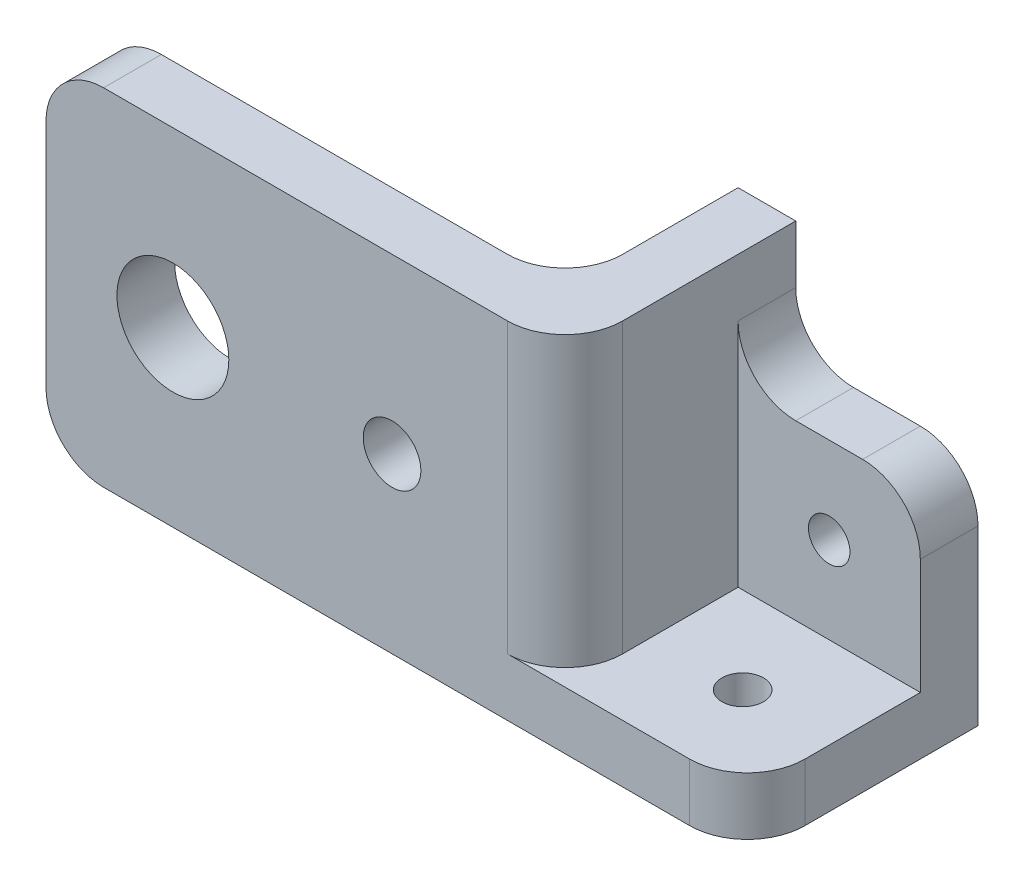
ISO-10303-21;
HEADER;
FILE_DESCRIPTION(('STEP AP214'),'2;1');
FILE_NAME('part.step','',(''),(''),'','','');
FILE_SCHEMA(('AUTOMOTIVE_DESIGN { 1 0 10303 214 1 1 1 1 }'));
ENDSEC;
DATA;
#1=APPLICATION_CONTEXT('core data for automotive mechanical design processes');
#2=APPLICATION_PROTOCOL_DEFINITION('international standard','automotive_design',2000,#1);
#3=PRODUCT_CONTEXT('',#1,'mechanical');
#4=PRODUCT('Part','Part','',(#3));
#5=PRODUCT_RELATED_PRODUCT_CATEGORY('part','',(#4));
#6=PRODUCT_DEFINITION_FORMATION('','',#4);
#7=PRODUCT_DEFINITION_CONTEXT('part definition',#1,'design');
#8=PRODUCT_DEFINITION('design','',#6,#7);
#9=PRODUCT_DEFINITION_SHAPE('','',#8);
#10=(LENGTH_UNIT() NAMED_UNIT(*) SI_UNIT(.MILLI.,.METRE.));
#11=(NAMED_UNIT(*) PLANE_ANGLE_UNIT() SI_UNIT($,.RADIAN.));
#12=(NAMED_UNIT(*) SI_UNIT($,.STERADIAN.) SOLID_ANGLE_UNIT());
#13=UNCERTAINTY_MEASURE_WITH_UNIT(LENGTH_MEASURE(1.E-05),#10,'distance_accuracy_value','');
#14=(GEOMETRIC_REPRESENTATION_CONTEXT(3) GLOBAL_UNCERTAINTY_ASSIGNED_CONTEXT((#13)) GLOBAL_UNIT_ASSIGNED_CONTEXT((#10,
#11,#12)) REPRESENTATION_CONTEXT('',''));
#15=CARTESIAN_POINT('',(0.,0.,0.));
#16=DIRECTION('',(0.,0.,1.));
#17=DIRECTION('',(1.,0.,0.));
#18=AXIS2_PLACEMENT_3D('',#15,#16,#17);
#19=CARTESIAN_POINT('',(10.033,6.35,12.7));
#20=DIRECTION('',(-1.,0.,0.));
#21=DIRECTION('',(0.,0.,1.));
#22=AXIS2_PLACEMENT_3D('',#19,#20,#21);
#23=PLANE('',#22);
#24=DIRECTION('',(0.,-1.,0.));
#25=VECTOR('',#24,1.);
#26=CARTESIAN_POINT('',(10.033,6.35,-12.7));
#27=LINE('',#26,#25);
#28=CARTESIAN_POINT('',(10.033,19.05,-12.7));
#29=VERTEX_POINT('',#28);
#30=CARTESIAN_POINT('',(10.033,0.,-12.7));
#31=VERTEX_POINT('',#30);
#32=EDGE_CURVE('E162',#29,#31,#27,.T.);
#33=ORIENTED_EDGE('',*,*,#32,.F.);
#34=DIRECTION('',(0.,0.,-1.));
#35=VECTOR('',#34,1.);
#36=CARTESIAN_POINT('',(10.033,19.05,-6.35));
#37=LINE('',#36,#35);
#38=CARTESIAN_POINT('',(10.033,19.05,-6.35));
#39=VERTEX_POINT('',#38);
#40=EDGE_CURVE('E56',#29,#39,#37,.F.);
#41=ORIENTED_EDGE('',*,*,#40,.T.);
#42=DIRECTION('',(0.,-1.,0.));
#43=VECTOR('',#42,1.);
#44=CARTESIAN_POINT('',(10.033,0.,-6.35));
#45=LINE('',#44,#43);
#46=CARTESIAN_POINT('',(10.033,6.35,-6.35));
#47=VERTEX_POINT('',#46);
#48=EDGE_CURVE('E202',#39,#47,#45,.T.);
#49=ORIENTED_EDGE('',*,*,#48,.T.);
#50=DIRECTION('',(0.,0.,-1.));
#51=VECTOR('',#50,1.);
#52=CARTESIAN_POINT('',(10.033,6.35,12.7));
#53=LINE('',#52,#51);
#54=CARTESIAN_POINT('',(10.033,6.35,6.35));
#55=VERTEX_POINT('',#54);
#56=EDGE_CURVE('E212',#55,#47,#53,.T.);
#57=ORIENTED_EDGE('',*,*,#56,.F.);
#58=DIRECTION('',(0.,-1.,0.));
#59=VECTOR('',#58,1.);
#60=CARTESIAN_POINT('',(10.033,6.35,6.35));
#61=LINE('',#60,#59);
#62=CARTESIAN_POINT('',(10.033,0.,6.35));
#63=VERTEX_POINT('',#62);
#64=EDGE_CURVE('E274',#55,#63,#61,.T.);
#65=ORIENTED_EDGE('',*,*,#64,.T.);
#66=DIRECTION('',(0.,0.,-1.));
#67=VECTOR('',#66,1.);
#68=CARTESIAN_POINT('',(10.033,0.,12.7));
#69=LINE('',#68,#67);
#70=EDGE_CURVE('E167',#63,#31,#69,.T.);
#71=ORIENTED_EDGE('',*,*,#70,.T.);
#72=EDGE_LOOP('',(#33,#41,#49,#57,#65,#71));
#73=FACE_BOUND('',#72,.T.);
#74=ADVANCED_FACE('F33',(#73),#23,.F.);
#75=CARTESIAN_POINT('',(-10.033,6.35,-12.7));
#76=DIRECTION('',(0.,0.,1.));
#77=DIRECTION('',(1.,0.,0.));
#78=AXIS2_PLACEMENT_3D('',#75,#76,#77);
#79=PLANE('',#78);
#80=CARTESIAN_POINT('',(0.,15.875,-12.7));
#81=DIRECTION('',(0.,0.,1.));
#82=DIRECTION('',(1.,0.,0.));
#83=AXIS2_PLACEMENT_3D('',#80,#81,#82);
#84=CIRCLE('',#83,2.286);
#85=CARTESIAN_POINT('',(2.286,15.875,-12.7));
#86=VERTEX_POINT('',#85);
#87=EDGE_CURVE('E562',#86,#86,#84,.T.);
#88=ORIENTED_EDGE('',*,*,#87,.T.);
#89=EDGE_LOOP('',(#88));
#90=FACE_BOUND('',#89,.T.);
#91=DIRECTION('',(1.,0.,0.));
#92=VECTOR('',#91,1.);
#93=CARTESIAN_POINT('',(10.033,25.4,-12.7));
#94=LINE('',#93,#92);
#95=CARTESIAN_POINT('',(-3.683,25.4,-12.7));
#96=VERTEX_POINT('',#95);
#97=CARTESIAN_POINT('',(3.683,25.4,-12.7));
#98=VERTEX_POINT('',#97);
#99=EDGE_CURVE('E201',#96,#98,#94,.T.);
#100=ORIENTED_EDGE('',*,*,#99,.T.);
#101=CARTESIAN_POINT('',(3.683,19.05,-12.7));
#102=DIRECTION('',(0.,0.,1.));
#103=DIRECTION('',(1.,0.,0.));
#104=AXIS2_PLACEMENT_3D('',#101,#102,#103);
#105=CIRCLE('',#104,6.35);
#106=EDGE_CURVE('E272',#98,#29,#105,.F.);
#107=ORIENTED_EDGE('',*,*,#106,.T.);
#108=ORIENTED_EDGE('',*,*,#32,.T.);
#109=DIRECTION('',(-1.,0.,0.));
#110=VECTOR('',#109,1.);
#111=CARTESIAN_POINT('',(-10.033,0.,-12.7));
#112=LINE('',#111,#110);
#113=CARTESIAN_POINT('',(-16.383,0.,-12.7));
#114=VERTEX_POINT('',#113);
#115=EDGE_CURVE('E155',#31,#114,#112,.T.);
#116=ORIENTED_EDGE('',*,*,#115,.T.);
#117=DIRECTION('',(0.,-1.,0.));
#118=VECTOR('',#117,1.);
#119=CARTESIAN_POINT('',(-16.383,0.,-12.7));
#120=LINE('',#119,#118);
#121=CARTESIAN_POINT('',(-16.383,38.1,-12.7));
#122=VERTEX_POINT('',#121);
#123=EDGE_CURVE('E161',#122,#114,#120,.T.);
#124=ORIENTED_EDGE('',*,*,#123,.F.);
#125=DIRECTION('',(1.,0.,0.));
#126=VECTOR('',#125,1.);
#127=CARTESIAN_POINT('',(-16.383,38.1,-12.7));
#128=LINE('',#127,#126);
#129=CARTESIAN_POINT('',(-10.033,38.1,-12.7));
#130=VERTEX_POINT('',#129);
#131=EDGE_CURVE('E193',#122,#130,#128,.T.);
#132=ORIENTED_EDGE('',*,*,#131,.T.);
#133=DIRECTION('',(0.,-1.,0.));
#134=VECTOR('',#133,1.);
#135=CARTESIAN_POINT('',(-10.033,0.,-12.7));
#136=LINE('',#135,#134);
#137=CARTESIAN_POINT('',(-10.033,31.75,-12.7));
#138=VERTEX_POINT('',#137);
#139=EDGE_CURVE('E186',#130,#138,#136,.T.);
#140=ORIENTED_EDGE('',*,*,#139,.T.);
#141=CARTESIAN_POINT('',(-3.683,31.75,-12.7));
#142=DIRECTION('',(0.,0.,1.));
#143=DIRECTION('',(1.,0.,0.));
#144=AXIS2_PLACEMENT_3D('',#141,#142,#143);
#145=CIRCLE('',#144,6.35);
#146=EDGE_CURVE('E41',#138,#96,#145,.T.);
#147=ORIENTED_EDGE('',*,*,#146,.T.);
#148=EDGE_LOOP('',(#100,#107,#108,#116,#124,#132,#140,#147));
#149=FACE_BOUND('',#148,.T.);
#150=ADVANCED_FACE('F158',(#90,#149),#79,.F.);
#151=CARTESIAN_POINT('',(-10.033,6.35,12.7));
#152=DIRECTION('',(0.,0.,-1.));
#153=DIRECTION('',(-1.,0.,0.));
#154=AXIS2_PLACEMENT_3D('',#151,#152,#153);
#155=PLANE('',#154);
#156=CARTESIAN_POINT('',(-53.213,19.05,12.7));
#157=DIRECTION('',(0.,0.,1.));
#158=DIRECTION('',(1.,0.,0.));
#159=AXIS2_PLACEMENT_3D('',#156,#157,#158);
#160=CIRCLE('',#159,6.15950000000001);
#161=CARTESIAN_POINT('',(-47.0535,19.05,12.7));
#162=VERTEX_POINT('',#161);
#163=EDGE_CURVE('E228',#162,#162,#160,.T.);
#164=ORIENTED_EDGE('',*,*,#163,.F.);
#165=EDGE_LOOP('',(#164));
#166=FACE_BOUND('',#165,.T.);
#167=CARTESIAN_POINT('',(-29.083,19.05,12.7));
#168=DIRECTION('',(0.,0.,1.));
#169=DIRECTION('',(1.,0.,0.));
#170=AXIS2_PLACEMENT_3D('',#167,#168,#169);
#171=CIRCLE('',#170,3.175);
#172=CARTESIAN_POINT('',(-25.908,19.05,12.7));
#173=VERTEX_POINT('',#172);
#174=EDGE_CURVE('E582',#173,#173,#171,.T.);
#175=ORIENTED_EDGE('',*,*,#174,.F.);
#176=EDGE_LOOP('',(#175));
#177=FACE_BOUND('',#176,.T.);
#178=DIRECTION('',(0.,-1.,0.));
#179=VECTOR('',#178,1.);
#180=CARTESIAN_POINT('',(-67.183,38.1,12.7));
#181=LINE('',#180,#179);
#182=CARTESIAN_POINT('',(-67.183,31.75,12.7));
#183=VERTEX_POINT('',#182);
#184=CARTESIAN_POINT('',(-67.183,6.35000000000002,12.7));
#185=VERTEX_POINT('',#184);
#186=EDGE_CURVE('E189',#183,#185,#181,.T.);
#187=ORIENTED_EDGE('',*,*,#186,.T.);
#188=CARTESIAN_POINT('',(-60.833,6.35,12.7));
#189=DIRECTION('',(0.,0.,-1.));
#190=DIRECTION('',(-1.,0.,0.));
#191=AXIS2_PLACEMENT_3D('',#188,#189,#190);
#192=CIRCLE('',#191,6.35);
#193=CARTESIAN_POINT('',(-60.833,0.,12.7));
#194=VERTEX_POINT('',#193);
#195=EDGE_CURVE('E243',#185,#194,#192,.F.);
#196=ORIENTED_EDGE('',*,*,#195,.T.);
#197=DIRECTION('',(1.,0.,0.));
#198=VECTOR('',#197,1.);
#199=CARTESIAN_POINT('',(-10.033,0.,12.7));
#200=LINE('',#199,#198);
#201=CARTESIAN_POINT('',(3.683,0.,12.7));
#202=VERTEX_POINT('',#201);
#203=EDGE_CURVE('E166',#194,#202,#200,.T.);
#204=ORIENTED_EDGE('',*,*,#203,.T.);
#205=DIRECTION('',(0.,-1.,0.));
#206=VECTOR('',#205,1.);
#207=CARTESIAN_POINT('',(3.683,6.35,12.7));
#208=LINE('',#207,#206);
#209=CARTESIAN_POINT('',(3.683,6.35,12.7));
#210=VERTEX_POINT('',#209);
#211=EDGE_CURVE('E236',#202,#210,#208,.F.);
#212=ORIENTED_EDGE('',*,*,#211,.T.);
#213=DIRECTION('',(1.,0.,0.));
#214=VECTOR('',#213,1.);
#215=CARTESIAN_POINT('',(-10.033,6.35,12.7));
#216=LINE('',#215,#214);
#217=CARTESIAN_POINT('',(-16.383,6.35,12.7));
#218=VERTEX_POINT('',#217);
#219=EDGE_CURVE('E217',#218,#210,#216,.T.);
#220=ORIENTED_EDGE('',*,*,#219,.F.);
#221=DIRECTION('',(0.,1.,0.));
#222=VECTOR('',#221,1.);
#223=CARTESIAN_POINT('',(-16.383,38.1,12.7));
#224=LINE('',#223,#222);
#225=CARTESIAN_POINT('',(-16.383,38.1,12.7));
#226=VERTEX_POINT('',#225);
#227=EDGE_CURVE('E238',#218,#226,#224,.T.);
#228=ORIENTED_EDGE('',*,*,#227,.T.);
#229=DIRECTION('',(1.,0.,0.));
#230=VECTOR('',#229,1.);
#231=CARTESIAN_POINT('',(-16.383,38.1,12.7));
#232=LINE('',#231,#230);
#233=CARTESIAN_POINT('',(-60.833,38.1,12.7));
#234=VERTEX_POINT('',#233);
#235=EDGE_CURVE('E198',#234,#226,#232,.T.);
#236=ORIENTED_EDGE('',*,*,#235,.F.);
#237=CARTESIAN_POINT('',(-60.833,31.75,12.7));
#238=DIRECTION('',(0.,0.,-1.));
#239=DIRECTION('',(-1.,0.,0.));
#240=AXIS2_PLACEMENT_3D('',#237,#238,#239);
#241=CIRCLE('',#240,6.35);
#242=EDGE_CURVE('E241',#234,#183,#241,.F.);
#243=ORIENTED_EDGE('',*,*,#242,.T.);
#244=EDGE_LOOP('',(#187,#196,#204,#212,#220,#228,#236,#243));
#245=FACE_BOUND('',#244,.T.);
#246=ADVANCED_FACE('F311',(#166,#177,#245),#155,.F.);
#247=CARTESIAN_POINT('',(0.,6.35,0.));
#248=DIRECTION('',(0.,-1.,0.));
#249=DIRECTION('',(0.,0.,-1.));
#250=AXIS2_PLACEMENT_3D('',#247,#248,#249);
#251=PLANE('',#250);
#252=CARTESIAN_POINT('',(0.,6.35,3.175));
#253=DIRECTION('',(0.,1.,0.));
#254=DIRECTION('',(0.,0.,1.));
#255=AXIS2_PLACEMENT_3D('',#252,#253,#254);
#256=CIRCLE('',#255,2.286);
#257=CARTESIAN_POINT('',(0.,6.35,5.461));
#258=VERTEX_POINT('',#257);
#259=EDGE_CURVE('E231',#258,#258,#256,.T.);
#260=ORIENTED_EDGE('',*,*,#259,.F.);
#261=EDGE_LOOP('',(#260));
#262=FACE_BOUND('',#261,.T.);
#263=ORIENTED_EDGE('',*,*,#219,.T.);
#264=CARTESIAN_POINT('',(3.683,6.35,6.35));
#265=DIRECTION('',(0.,-1.,0.));
#266=DIRECTION('',(0.,0.,-1.));
#267=AXIS2_PLACEMENT_3D('',#264,#265,#266);
#268=CIRCLE('',#267,6.35);
#269=EDGE_CURVE('E48',#210,#55,#268,.F.);
#270=ORIENTED_EDGE('',*,*,#269,.T.);
#271=ORIENTED_EDGE('',*,*,#56,.T.);
#272=DIRECTION('',(-1.,0.,0.));
#273=VECTOR('',#272,1.);
#274=CARTESIAN_POINT('',(0.,6.35,-6.35));
#275=LINE('',#274,#273);
#276=CARTESIAN_POINT('',(-10.033,6.35,-6.35));
#277=VERTEX_POINT('',#276);
#278=EDGE_CURVE('E209',#47,#277,#275,.T.);
#279=ORIENTED_EDGE('',*,*,#278,.T.);
#280=DIRECTION('',(0.,0.,1.));
#281=VECTOR('',#280,1.);
#282=CARTESIAN_POINT('',(-10.033,6.35,12.7));
#283=LINE('',#282,#281);
#284=CARTESIAN_POINT('',(-10.033,6.35,6.35));
#285=VERTEX_POINT('',#284);
#286=EDGE_CURVE('E214',#277,#285,#283,.T.);
#287=ORIENTED_EDGE('',*,*,#286,.T.);
#288=CARTESIAN_POINT('',(-16.383,6.35,6.35));
#289=DIRECTION('',(0.,-1.,0.));
#290=DIRECTION('',(0.,0.,-1.));
#291=AXIS2_PLACEMENT_3D('',#288,#289,#290);
#292=CIRCLE('',#291,6.35);
#293=EDGE_CURVE('E284',#285,#218,#292,.T.);
#294=ORIENTED_EDGE('',*,*,#293,.T.);
#295=EDGE_LOOP('',(#263,#270,#271,#279,#287,#294));
#296=FACE_BOUND('',#295,.T.);
#297=ADVANCED_FACE('F457',(#262,#296),#251,.F.);
#298=CARTESIAN_POINT('',(0.,0.,0.));
#299=DIRECTION('',(0.,-1.,0.));
#300=DIRECTION('',(0.,0.,-1.));
#301=AXIS2_PLACEMENT_3D('',#298,#299,#300);
#302=PLANE('',#301);
#303=CARTESIAN_POINT('',(0.,0.,3.175));
#304=DIRECTION('',(0.,1.,0.));
#305=DIRECTION('',(0.,0.,1.));
#306=AXIS2_PLACEMENT_3D('',#303,#304,#305);
#307=CIRCLE('',#306,2.286);
#308=CARTESIAN_POINT('',(0.,0.,5.461));
#309=VERTEX_POINT('',#308);
#310=EDGE_CURVE('E570',#309,#309,#307,.T.);
#311=ORIENTED_EDGE('',*,*,#310,.T.);
#312=EDGE_LOOP('',(#311));
#313=FACE_BOUND('',#312,.T.);
#314=ORIENTED_EDGE('',*,*,#203,.F.);
#315=DIRECTION('',(0.,0.,1.));
#316=VECTOR('',#315,1.);
#317=CARTESIAN_POINT('',(-60.833,0.,0.));
#318=LINE('',#317,#316);
#319=CARTESIAN_POINT('',(-60.833,0.,6.35));
#320=VERTEX_POINT('',#319);
#321=EDGE_CURVE('E247',#194,#320,#318,.F.);
#322=ORIENTED_EDGE('',*,*,#321,.T.);
#323=DIRECTION('',(1.,0.,0.));
#324=VECTOR('',#323,1.);
#325=CARTESIAN_POINT('',(-16.383,0.,6.35));
#326=LINE('',#325,#324);
#327=CARTESIAN_POINT('',(-22.733,0.,6.35));
#328=VERTEX_POINT('',#327);
#329=EDGE_CURVE('E195',#320,#328,#326,.T.);
#330=ORIENTED_EDGE('',*,*,#329,.T.);
#331=CARTESIAN_POINT('',(-22.733,0.,0.));
#332=DIRECTION('',(0.,-1.,0.));
#333=DIRECTION('',(0.,0.,-1.));
#334=AXIS2_PLACEMENT_3D('',#331,#332,#333);
#335=CIRCLE('',#334,6.35);
#336=CARTESIAN_POINT('',(-16.383,0.,0.));
#337=VERTEX_POINT('',#336);
#338=EDGE_CURVE('E175',#328,#337,#335,.F.);
#339=ORIENTED_EDGE('',*,*,#338,.T.);
#340=DIRECTION('',(0.,0.,1.));
#341=VECTOR('',#340,1.);
#342=CARTESIAN_POINT('',(-16.383,0.,-12.7));
#343=LINE('',#342,#341);
#344=EDGE_CURVE('E170',#114,#337,#343,.T.);
#345=ORIENTED_EDGE('',*,*,#344,.F.);
#346=ORIENTED_EDGE('',*,*,#115,.F.);
#347=ORIENTED_EDGE('',*,*,#70,.F.);
#348=CARTESIAN_POINT('',(3.683,0.,6.35));
#349=DIRECTION('',(0.,-1.,0.));
#350=DIRECTION('',(0.,0.,-1.));
#351=AXIS2_PLACEMENT_3D('',#348,#349,#350);
#352=CIRCLE('',#351,6.35);
#353=EDGE_CURVE('E245',#63,#202,#352,.T.);
#354=ORIENTED_EDGE('',*,*,#353,.T.);
#355=EDGE_LOOP('',(#314,#322,#330,#339,#345,#346,#347,#354));
#356=FACE_BOUND('',#355,.T.);
#357=ADVANCED_FACE('F172',(#313,#356),#302,.T.);
#358=CARTESIAN_POINT('',(0.,0.,-6.35));
#359=DIRECTION('',(0.,0.,1.));
#360=DIRECTION('',(1.,0.,0.));
#361=AXIS2_PLACEMENT_3D('',#358,#359,#360);
#362=PLANE('',#361);
#363=CARTESIAN_POINT('',(0.,15.875,-6.35));
#364=DIRECTION('',(0.,0.,1.));
#365=DIRECTION('',(1.,0.,0.));
#366=AXIS2_PLACEMENT_3D('',#363,#364,#365);
#367=CIRCLE('',#366,2.286);
#368=CARTESIAN_POINT('',(2.286,15.875,-6.35));
#369=VERTEX_POINT('',#368);
#370=EDGE_CURVE('E566',#369,#369,#367,.T.);
#371=ORIENTED_EDGE('',*,*,#370,.F.);
#372=EDGE_LOOP('',(#371));
#373=FACE_BOUND('',#372,.T.);
#374=ORIENTED_EDGE('',*,*,#48,.F.);
#375=CARTESIAN_POINT('',(3.683,19.05,-6.35));
#376=DIRECTION('',(0.,0.,1.));
#377=DIRECTION('',(1.,0.,0.));
#378=AXIS2_PLACEMENT_3D('',#375,#376,#377);
#379=CIRCLE('',#378,6.35);
#380=CARTESIAN_POINT('',(3.683,25.4,-6.35));
#381=VERTEX_POINT('',#380);
#382=EDGE_CURVE('E278',#39,#381,#379,.T.);
#383=ORIENTED_EDGE('',*,*,#382,.T.);
#384=DIRECTION('',(1.,0.,0.));
#385=VECTOR('',#384,1.);
#386=CARTESIAN_POINT('',(10.033,25.4,-6.35));
#387=LINE('',#386,#385);
#388=CARTESIAN_POINT('',(-3.683,25.4,-6.35));
#389=VERTEX_POINT('',#388);
#390=EDGE_CURVE('E206',#389,#381,#387,.T.);
#391=ORIENTED_EDGE('',*,*,#390,.F.);
#392=CARTESIAN_POINT('',(-3.683,31.75,-6.35));
#393=DIRECTION('',(0.,0.,1.));
#394=DIRECTION('',(1.,0.,0.));
#395=AXIS2_PLACEMENT_3D('',#392,#393,#394);
#396=CIRCLE('',#395,6.35);
#397=CARTESIAN_POINT('',(-10.033,31.75,-6.35));
#398=VERTEX_POINT('',#397);
#399=EDGE_CURVE('E11',#389,#398,#396,.F.);
#400=ORIENTED_EDGE('',*,*,#399,.T.);
#401=DIRECTION('',(0.,1.,0.));
#402=VECTOR('',#401,1.);
#403=CARTESIAN_POINT('',(-10.033,0.,-6.35));
#404=LINE('',#403,#402);
#405=EDGE_CURVE('E204',#277,#398,#404,.T.);
#406=ORIENTED_EDGE('',*,*,#405,.F.);
#407=ORIENTED_EDGE('',*,*,#278,.F.);
#408=EDGE_LOOP('',(#374,#383,#391,#400,#406,#407));
#409=FACE_BOUND('',#408,.T.);
#410=ADVANCED_FACE('F299',(#373,#409),#362,.T.);
#411=CARTESIAN_POINT('',(10.033,25.4,-6.35));
#412=DIRECTION('',(0.,1.,0.));
#413=DIRECTION('',(0.,0.,1.));
#414=AXIS2_PLACEMENT_3D('',#411,#412,#413);
#415=PLANE('',#414);
#416=ORIENTED_EDGE('',*,*,#99,.F.);
#417=DIRECTION('',(0.,0.,-1.));
#418=VECTOR('',#417,1.);
#419=CARTESIAN_POINT('',(-3.683,25.4,-6.35));
#420=LINE('',#419,#418);
#421=EDGE_CURVE('E270',#96,#389,#420,.F.);
#422=ORIENTED_EDGE('',*,*,#421,.T.);
#423=ORIENTED_EDGE('',*,*,#390,.T.);
#424=DIRECTION('',(0.,0.,-1.));
#425=VECTOR('',#424,1.);
#426=CARTESIAN_POINT('',(3.683,25.4,-12.7));
#427=LINE('',#426,#425);
#428=EDGE_CURVE('E267',#381,#98,#427,.T.);
#429=ORIENTED_EDGE('',*,*,#428,.T.);
#430=EDGE_LOOP('',(#416,#422,#423,#429));
#431=FACE_BOUND('',#430,.T.);
#432=ADVANCED_FACE('F292',(#431),#415,.T.);
#433=CARTESIAN_POINT('',(-10.033,0.,0.));
#434=DIRECTION('',(1.,0.,0.));
#435=DIRECTION('',(0.,0.,-1.));
#436=AXIS2_PLACEMENT_3D('',#433,#434,#435);
#437=PLANE('',#436);
#438=DIRECTION('',(0.,0.,-1.));
#439=VECTOR('',#438,1.);
#440=CARTESIAN_POINT('',(-10.033,38.1,-12.7));
#441=LINE('',#440,#439);
#442=CARTESIAN_POINT('',(-10.033,38.1,6.35));
#443=VERTEX_POINT('',#442);
#444=EDGE_CURVE('E184',#443,#130,#441,.T.);
#445=ORIENTED_EDGE('',*,*,#444,.F.);
#446=DIRECTION('',(0.,1.,0.));
#447=VECTOR('',#446,1.);
#448=CARTESIAN_POINT('',(-10.033,6.35,6.35));
#449=LINE('',#448,#447);
#450=EDGE_CURVE('E265',#443,#285,#449,.F.);
#451=ORIENTED_EDGE('',*,*,#450,.T.);
#452=ORIENTED_EDGE('',*,*,#286,.F.);
#453=ORIENTED_EDGE('',*,*,#405,.T.);
#454=DIRECTION('',(0.,0.,-1.));
#455=VECTOR('',#454,1.);
#456=CARTESIAN_POINT('',(-10.033,31.75,-12.7));
#457=LINE('',#456,#455);
#458=EDGE_CURVE('E262',#398,#138,#457,.T.);
#459=ORIENTED_EDGE('',*,*,#458,.T.);
#460=ORIENTED_EDGE('',*,*,#139,.F.);
#461=EDGE_LOOP('',(#445,#451,#452,#453,#459,#460));
#462=FACE_BOUND('',#461,.T.);
#463=ADVANCED_FACE('F442',(#462),#437,.T.);
#464=CARTESIAN_POINT('',(-16.383,38.1,-12.7));
#465=DIRECTION('',(0.,-1.,0.));
#466=DIRECTION('',(0.,0.,-1.));
#467=AXIS2_PLACEMENT_3D('',#464,#465,#466);
#468=PLANE('',#467);
#469=DIRECTION('',(-1.,0.,0.));
#470=VECTOR('',#469,1.);
#471=CARTESIAN_POINT('',(-16.383,38.1,6.35));
#472=LINE('',#471,#470);
#473=CARTESIAN_POINT('',(-22.733,38.1,6.35));
#474=VERTEX_POINT('',#473);
#475=CARTESIAN_POINT('',(-60.833,38.1,6.35));
#476=VERTEX_POINT('',#475);
#477=EDGE_CURVE('E555',#474,#476,#472,.T.);
#478=ORIENTED_EDGE('',*,*,#477,.T.);
#479=DIRECTION('',(0.,0.,1.));
#480=VECTOR('',#479,1.);
#481=CARTESIAN_POINT('',(-60.833,38.1,12.7));
#482=LINE('',#481,#480);
#483=EDGE_CURVE('E257',#476,#234,#482,.T.);
#484=ORIENTED_EDGE('',*,*,#483,.T.);
#485=ORIENTED_EDGE('',*,*,#235,.T.);
#486=CARTESIAN_POINT('',(-16.383,38.1,6.35));
#487=DIRECTION('',(0.,-1.,0.));
#488=DIRECTION('',(0.,0.,-1.));
#489=AXIS2_PLACEMENT_3D('',#486,#487,#488);
#490=CIRCLE('',#489,6.35);
#491=EDGE_CURVE('E255',#226,#443,#490,.F.);
#492=ORIENTED_EDGE('',*,*,#491,.T.);
#493=ORIENTED_EDGE('',*,*,#444,.T.);
#494=ORIENTED_EDGE('',*,*,#131,.F.);
#495=DIRECTION('',(0.,0.,-1.));
#496=VECTOR('',#495,1.);
#497=CARTESIAN_POINT('',(-16.383,38.1,-12.7));
#498=LINE('',#497,#496);
#499=CARTESIAN_POINT('',(-16.383,38.1,0.));
#500=VERTEX_POINT('',#499);
#501=EDGE_CURVE('E179',#500,#122,#498,.T.);
#502=ORIENTED_EDGE('',*,*,#501,.F.);
#503=CARTESIAN_POINT('',(-22.733,38.1,0.));
#504=DIRECTION('',(0.,-1.,0.));
#505=DIRECTION('',(0.,0.,-1.));
#506=AXIS2_PLACEMENT_3D('',#503,#504,#505);
#507=CIRCLE('',#506,6.35);
#508=EDGE_CURVE('E281',#500,#474,#507,.T.);
#509=ORIENTED_EDGE('',*,*,#508,.T.);
#510=EDGE_LOOP('',(#478,#484,#485,#492,#493,#494,#502,#509));
#511=FACE_BOUND('',#510,.T.);
#512=ADVANCED_FACE('F435',(#511),#468,.F.);
#513=CARTESIAN_POINT('',(-16.383,0.,0.));
#514=DIRECTION('',(1.,0.,0.));
#515=DIRECTION('',(0.,0.,-1.));
#516=AXIS2_PLACEMENT_3D('',#513,#514,#515);
#517=PLANE('',#516);
#518=ORIENTED_EDGE('',*,*,#344,.T.);
#519=DIRECTION('',(0.,1.,0.));
#520=VECTOR('',#519,1.);
#521=CARTESIAN_POINT('',(-16.383,0.,0.));
#522=LINE('',#521,#520);
#523=EDGE_CURVE('E260',#337,#500,#522,.T.);
#524=ORIENTED_EDGE('',*,*,#523,.T.);
#525=ORIENTED_EDGE('',*,*,#501,.T.);
#526=ORIENTED_EDGE('',*,*,#123,.T.);
#527=EDGE_LOOP('',(#518,#524,#525,#526));
#528=FACE_BOUND('',#527,.T.);
#529=ADVANCED_FACE('F181',(#528),#517,.F.);
#530=CARTESIAN_POINT('',(-67.183,38.1,6.35));
#531=DIRECTION('',(-1.,0.,0.));
#532=DIRECTION('',(0.,0.,1.));
#533=AXIS2_PLACEMENT_3D('',#530,#531,#532);
#534=PLANE('',#533);
#535=DIRECTION('',(0.,-1.,0.));
#536=VECTOR('',#535,1.);
#537=CARTESIAN_POINT('',(-67.183,38.1,6.35));
#538=LINE('',#537,#536);
#539=CARTESIAN_POINT('',(-67.183,31.75,6.35));
#540=VERTEX_POINT('',#539);
#541=CARTESIAN_POINT('',(-67.183,6.35000000000002,6.35));
#542=VERTEX_POINT('',#541);
#543=EDGE_CURVE('E563',#540,#542,#538,.T.);
#544=ORIENTED_EDGE('',*,*,#543,.T.);
#545=DIRECTION('',(0.,0.,1.));
#546=VECTOR('',#545,1.);
#547=CARTESIAN_POINT('',(-67.183,6.35,6.35));
#548=LINE('',#547,#546);
#549=EDGE_CURVE('E233',#542,#185,#548,.T.);
#550=ORIENTED_EDGE('',*,*,#549,.T.);
#551=ORIENTED_EDGE('',*,*,#186,.F.);
#552=DIRECTION('',(0.,0.,1.));
#553=VECTOR('',#552,1.);
#554=CARTESIAN_POINT('',(-67.183,31.75,6.35));
#555=LINE('',#554,#553);
#556=EDGE_CURVE('E223',#183,#540,#555,.F.);
#557=ORIENTED_EDGE('',*,*,#556,.T.);
#558=EDGE_LOOP('',(#544,#550,#551,#557));
#559=FACE_BOUND('',#558,.T.);
#560=ADVANCED_FACE('F422',(#559),#534,.T.);
#561=CARTESIAN_POINT('',(0.,0.,6.35));
#562=DIRECTION('',(0.,0.,-1.));
#563=DIRECTION('',(-1.,0.,0.));
#564=AXIS2_PLACEMENT_3D('',#561,#562,#563);
#565=PLANE('',#564);
#566=CARTESIAN_POINT('',(-53.213,19.05,6.35));
#567=DIRECTION('',(0.,0.,-1.));
#568=DIRECTION('',(-1.,0.,0.));
#569=AXIS2_PLACEMENT_3D('',#566,#567,#568);
#570=CIRCLE('',#569,6.15950000000001);
#571=CARTESIAN_POINT('',(-59.3725,19.05,6.35));
#572=VERTEX_POINT('',#571);
#573=EDGE_CURVE('E227',#572,#572,#570,.T.);
#574=ORIENTED_EDGE('',*,*,#573,.F.);
#575=EDGE_LOOP('',(#574));
#576=FACE_BOUND('',#575,.T.);
#577=CARTESIAN_POINT('',(-29.083,19.05,6.35));
#578=DIRECTION('',(0.,0.,-1.));
#579=DIRECTION('',(-1.,0.,0.));
#580=AXIS2_PLACEMENT_3D('',#577,#578,#579);
#581=CIRCLE('',#580,3.175);
#582=CARTESIAN_POINT('',(-32.258,19.05,6.35));
#583=VERTEX_POINT('',#582);
#584=EDGE_CURVE('E224',#583,#583,#581,.T.);
#585=ORIENTED_EDGE('',*,*,#584,.F.);
#586=EDGE_LOOP('',(#585));
#587=FACE_BOUND('',#586,.T.);
#588=ORIENTED_EDGE('',*,*,#329,.F.);
#589=CARTESIAN_POINT('',(-60.833,6.35,6.35));
#590=DIRECTION('',(0.,0.,-1.));
#591=DIRECTION('',(-1.,0.,0.));
#592=AXIS2_PLACEMENT_3D('',#589,#590,#591);
#593=CIRCLE('',#592,6.35);
#594=EDGE_CURVE('E253',#320,#542,#593,.T.);
#595=ORIENTED_EDGE('',*,*,#594,.T.);
#596=ORIENTED_EDGE('',*,*,#543,.F.);
#597=CARTESIAN_POINT('',(-60.833,31.75,6.35));
#598=DIRECTION('',(0.,0.,-1.));
#599=DIRECTION('',(-1.,0.,0.));
#600=AXIS2_PLACEMENT_3D('',#597,#598,#599);
#601=CIRCLE('',#600,6.35);
#602=EDGE_CURVE('E251',#540,#476,#601,.T.);
#603=ORIENTED_EDGE('',*,*,#602,.T.);
#604=ORIENTED_EDGE('',*,*,#477,.F.);
#605=DIRECTION('',(0.,1.,0.));
#606=VECTOR('',#605,1.);
#607=CARTESIAN_POINT('',(-22.733,0.,6.35));
#608=LINE('',#607,#606);
#609=EDGE_CURVE('E249',#474,#328,#608,.F.);
#610=ORIENTED_EDGE('',*,*,#609,.T.);
#611=EDGE_LOOP('',(#588,#595,#596,#603,#604,#610));
#612=FACE_BOUND('',#611,.T.);
#613=ADVANCED_FACE('F414',(#576,#587,#612),#565,.T.);
#614=CARTESIAN_POINT('',(0.,15.875,-12.7));
#615=DIRECTION('',(0.,0.,1.));
#616=DIRECTION('',(1.,0.,0.));
#617=AXIS2_PLACEMENT_3D('',#614,#615,#616);
#618=CYLINDRICAL_SURFACE('',#617,2.286);
#619=ORIENTED_EDGE('',*,*,#87,.F.);
#620=EDGE_LOOP('',(#619));
#621=FACE_BOUND('',#620,.T.);
#622=ORIENTED_EDGE('',*,*,#370,.T.);
#623=EDGE_LOOP('',(#622));
#624=FACE_BOUND('',#623,.T.);
#625=ADVANCED_FACE('F405',(#621,#624),#618,.F.);
#626=CARTESIAN_POINT('',(0.,0.,3.175));
#627=DIRECTION('',(0.,1.,0.));
#628=DIRECTION('',(0.,0.,1.));
#629=AXIS2_PLACEMENT_3D('',#626,#627,#628);
#630=CYLINDRICAL_SURFACE('',#629,2.286);
#631=ORIENTED_EDGE('',*,*,#310,.F.);
#632=EDGE_LOOP('',(#631));
#633=FACE_BOUND('',#632,.T.);
#634=ORIENTED_EDGE('',*,*,#259,.T.);
#635=EDGE_LOOP('',(#634));
#636=FACE_BOUND('',#635,.T.);
#637=ADVANCED_FACE('F396',(#633,#636),#630,.F.);
#638=CARTESIAN_POINT('',(-29.083,19.05,-12.7));
#639=DIRECTION('',(0.,0.,1.));
#640=DIRECTION('',(1.,0.,0.));
#641=AXIS2_PLACEMENT_3D('',#638,#639,#640);
#642=CYLINDRICAL_SURFACE('',#641,3.175);
#643=ORIENTED_EDGE('',*,*,#584,.T.);
#644=EDGE_LOOP('',(#643));
#645=FACE_BOUND('',#644,.T.);
#646=ORIENTED_EDGE('',*,*,#174,.T.);
#647=EDGE_LOOP('',(#646));
#648=FACE_BOUND('',#647,.T.);
#649=ADVANCED_FACE('F387',(#645,#648),#642,.F.);
#650=CARTESIAN_POINT('',(-53.213,19.05,-12.7));
#651=DIRECTION('',(0.,0.,1.));
#652=DIRECTION('',(1.,0.,0.));
#653=AXIS2_PLACEMENT_3D('',#650,#651,#652);
#654=CYLINDRICAL_SURFACE('',#653,6.15950000000001);
#655=ORIENTED_EDGE('',*,*,#573,.T.);
#656=EDGE_LOOP('',(#655));
#657=FACE_BOUND('',#656,.T.);
#658=ORIENTED_EDGE('',*,*,#163,.T.);
#659=EDGE_LOOP('',(#658));
#660=FACE_BOUND('',#659,.T.);
#661=ADVANCED_FACE('F329',(#657,#660),#654,.F.);
#662=CARTESIAN_POINT('',(-60.833,6.35,6.35));
#663=DIRECTION('',(0.,0.,1.));
#664=DIRECTION('',(1.,0.,0.));
#665=AXIS2_PLACEMENT_3D('',#662,#663,#664);
#666=CYLINDRICAL_SURFACE('',#665,6.35);
#667=ORIENTED_EDGE('',*,*,#594,.F.);
#668=ORIENTED_EDGE('',*,*,#321,.F.);
#669=ORIENTED_EDGE('',*,*,#195,.F.);
#670=ORIENTED_EDGE('',*,*,#549,.F.);
#671=EDGE_LOOP('',(#667,#668,#669,#670));
#672=FACE_BOUND('',#671,.T.);
#673=ADVANCED_FACE('F325',(#672),#666,.T.);
#674=CARTESIAN_POINT('',(-60.833,31.75,-12.7));
#675=DIRECTION('',(0.,0.,-1.));
#676=DIRECTION('',(-1.,0.,0.));
#677=AXIS2_PLACEMENT_3D('',#674,#675,#676);
#678=CYLINDRICAL_SURFACE('',#677,6.35);
#679=ORIENTED_EDGE('',*,*,#602,.F.);
#680=ORIENTED_EDGE('',*,*,#556,.F.);
#681=ORIENTED_EDGE('',*,*,#242,.F.);
#682=ORIENTED_EDGE('',*,*,#483,.F.);
#683=EDGE_LOOP('',(#679,#680,#681,#682));
#684=FACE_BOUND('',#683,.T.);
#685=ADVANCED_FACE('F328',(#684),#678,.T.);
#686=CARTESIAN_POINT('',(-22.733,0.,0.));
#687=DIRECTION('',(0.,1.,0.));
#688=DIRECTION('',(0.,0.,1.));
#689=AXIS2_PLACEMENT_3D('',#686,#687,#688);
#690=CYLINDRICAL_SURFACE('',#689,6.35);
#691=ORIENTED_EDGE('',*,*,#338,.F.);
#692=ORIENTED_EDGE('',*,*,#609,.F.);
#693=ORIENTED_EDGE('',*,*,#508,.F.);
#694=ORIENTED_EDGE('',*,*,#523,.F.);
#695=EDGE_LOOP('',(#691,#692,#693,#694));
#696=FACE_BOUND('',#695,.T.);
#697=ADVANCED_FACE('F333',(#696),#690,.F.);
#698=CARTESIAN_POINT('',(-16.383,6.35,6.35));
#699=DIRECTION('',(0.,-1.,0.));
#700=DIRECTION('',(0.,0.,-1.));
#701=AXIS2_PLACEMENT_3D('',#698,#699,#700);
#702=CYLINDRICAL_SURFACE('',#701,6.35);
#703=ORIENTED_EDGE('',*,*,#293,.F.);
#704=ORIENTED_EDGE('',*,*,#450,.F.);
#705=ORIENTED_EDGE('',*,*,#491,.F.);
#706=ORIENTED_EDGE('',*,*,#227,.F.);
#707=EDGE_LOOP('',(#703,#704,#705,#706));
#708=FACE_BOUND('',#707,.T.);
#709=ADVANCED_FACE('F337',(#708),#702,.T.);
#710=CARTESIAN_POINT('',(-3.683,31.75,0.));
#711=DIRECTION('',(0.,0.,1.));
#712=DIRECTION('',(1.,0.,0.));
#713=AXIS2_PLACEMENT_3D('',#710,#711,#712);
#714=CYLINDRICAL_SURFACE('',#713,6.35);
#715=ORIENTED_EDGE('',*,*,#399,.F.);
#716=ORIENTED_EDGE('',*,*,#421,.F.);
#717=ORIENTED_EDGE('',*,*,#146,.F.);
#718=ORIENTED_EDGE('',*,*,#458,.F.);
#719=EDGE_LOOP('',(#715,#716,#717,#718));
#720=FACE_BOUND('',#719,.T.);
#721=ADVANCED_FACE('F296',(#720),#714,.F.);
#722=CARTESIAN_POINT('',(3.683,19.05,-6.35));
#723=DIRECTION('',(0.,0.,1.));
#724=DIRECTION('',(1.,0.,0.));
#725=AXIS2_PLACEMENT_3D('',#722,#723,#724);
#726=CYLINDRICAL_SURFACE('',#725,6.35);
#727=ORIENTED_EDGE('',*,*,#382,.F.);
#728=ORIENTED_EDGE('',*,*,#40,.F.);
#729=ORIENTED_EDGE('',*,*,#106,.F.);
#730=ORIENTED_EDGE('',*,*,#428,.F.);
#731=EDGE_LOOP('',(#727,#728,#729,#730));
#732=FACE_BOUND('',#731,.T.);
#733=ADVANCED_FACE('F304',(#732),#726,.T.);
#734=CARTESIAN_POINT('',(3.683,6.35,6.35));
#735=DIRECTION('',(0.,-1.,0.));
#736=DIRECTION('',(0.,0.,-1.));
#737=AXIS2_PLACEMENT_3D('',#734,#735,#736);
#738=CYLINDRICAL_SURFACE('',#737,6.35);
#739=ORIENTED_EDGE('',*,*,#269,.F.);
#740=ORIENTED_EDGE('',*,*,#211,.F.);
#741=ORIENTED_EDGE('',*,*,#353,.F.);
#742=ORIENTED_EDGE('',*,*,#64,.F.);
#743=EDGE_LOOP('',(#739,#740,#741,#742));
#744=FACE_BOUND('',#743,.T.);
#745=ADVANCED_FACE('F35',(#744),#738,.T.);
#746=CLOSED_SHELL('',(#74,#150,#246,#297,#357,#410,#432,#463,#512,#529,#560,#613,#625,#637,#649,
#661,#673,#685,#697,#709,#721,#733,#745));
#747=MANIFOLD_SOLID_BREP('B2',#746);
#748=ADVANCED_BREP_SHAPE_REPRESENTATION('',(#18,#747),#14);
#749=SHAPE_DEFINITION_REPRESENTATION(#9,#748);
ENDSEC;
END-ISO-10303-21;
